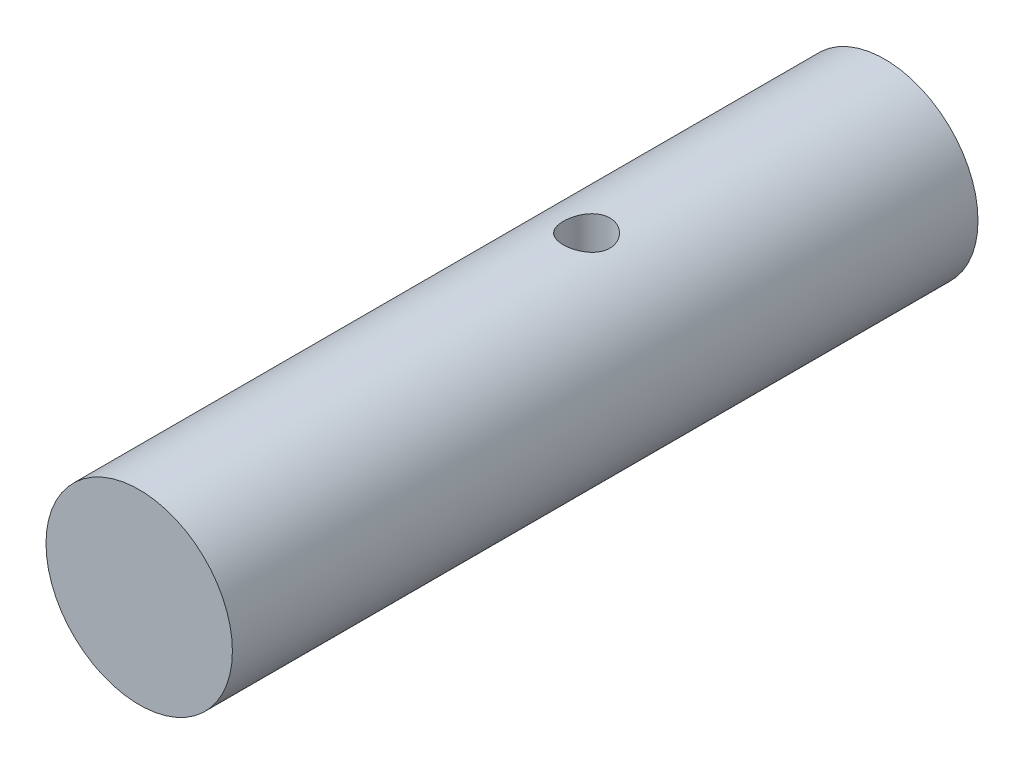
ISO-10303-21;
HEADER;
FILE_DESCRIPTION(('STEP AP214'),'2;1');
FILE_NAME('part.step','',(''),(''),'','','');
FILE_SCHEMA(('AUTOMOTIVE_DESIGN { 1 0 10303 214 1 1 1 1 }'));
ENDSEC;
DATA;
#1=APPLICATION_CONTEXT('core data for automotive mechanical design processes');
#2=APPLICATION_PROTOCOL_DEFINITION('international standard','automotive_design',2000,#1);
#3=PRODUCT_CONTEXT('',#1,'mechanical');
#4=PRODUCT('Part','Part','',(#3));
#5=PRODUCT_RELATED_PRODUCT_CATEGORY('part','',(#4));
#6=PRODUCT_DEFINITION_FORMATION('','',#4);
#7=PRODUCT_DEFINITION_CONTEXT('part definition',#1,'design');
#8=PRODUCT_DEFINITION('design','',#6,#7);
#9=PRODUCT_DEFINITION_SHAPE('','',#8);
#10=(LENGTH_UNIT() NAMED_UNIT(*) SI_UNIT(.MILLI.,.METRE.));
#11=(NAMED_UNIT(*) PLANE_ANGLE_UNIT() SI_UNIT($,.RADIAN.));
#12=(NAMED_UNIT(*) SI_UNIT($,.STERADIAN.) SOLID_ANGLE_UNIT());
#13=UNCERTAINTY_MEASURE_WITH_UNIT(LENGTH_MEASURE(1.E-05),#10,'distance_accuracy_value','');
#14=(GEOMETRIC_REPRESENTATION_CONTEXT(3) GLOBAL_UNCERTAINTY_ASSIGNED_CONTEXT((#13)) GLOBAL_UNIT_ASSIGNED_CONTEXT((#10,
#11,#12)) REPRESENTATION_CONTEXT('',''));
#15=CARTESIAN_POINT('',(0.,0.,0.));
#16=DIRECTION('',(0.,0.,1.));
#17=DIRECTION('',(1.,0.,0.));
#18=AXIS2_PLACEMENT_3D('',#15,#16,#17);
#19=CARTESIAN_POINT('',(0.,0.,40.));
#20=DIRECTION('',(0.,0.,-1.));
#21=DIRECTION('',(-1.,0.,0.));
#22=AXIS2_PLACEMENT_3D('',#19,#20,#21);
#23=CYLINDRICAL_SURFACE('',#22,5.);
#24=CARTESIAN_POINT('',(0.,-5.,17.25));
#25=CARTESIAN_POINT('',(0.0690634072247779,-4.99999883223344,17.2499980618849));
#26=CARTESIAN_POINT('',(0.138148464858971,-4.99855481776523,17.2442570410218));
#27=CARTESIAN_POINT('',(0.274338603142113,-4.99293428191577,17.2214790405775));
#28=CARTESIAN_POINT('',(0.341442539058951,-4.98875621183307,17.2044356587185));
#29=CARTESIAN_POINT('',(0.47168406015215,-4.97813021943367,17.1596339554483));
#30=CARTESIAN_POINT('',(0.53482630285834,-4.97168502368406,17.1318885010706));
#31=CARTESIAN_POINT('',(0.655560109920359,-4.95721119839661,17.066515508296));
#32=CARTESIAN_POINT('',(0.713151486957302,-4.94918251545042,17.0288876365675));
#33=CARTESIAN_POINT('',(0.822334939417436,-4.93222844659834,16.9439993419548));
#34=CARTESIAN_POINT('',(0.873796408384229,-4.92328922623777,16.896573687534));
#35=CARTESIAN_POINT('',(0.968124106002756,-4.90561350097941,16.7937898292426));
#36=CARTESIAN_POINT('',(1.01098936412428,-4.89687701906957,16.7384307308779));
#37=CARTESIAN_POINT('',(1.0875221189992,-4.88045646416425,16.6203373110521));
#38=CARTESIAN_POINT('',(1.12104351327113,-4.87278995392171,16.5575056409913));
#39=CARTESIAN_POINT('',(1.17699742379211,-4.85957912343519,16.426876323618));
#40=CARTESIAN_POINT('',(1.19943171286611,-4.85403446393991,16.3590794722285));
#41=CARTESIAN_POINT('',(1.23212903067024,-4.84583730597959,16.2218804181646));
#42=CARTESIAN_POINT('',(1.24262689027778,-4.84312909229521,16.1525375866252));
#43=CARTESIAN_POINT('',(1.25188481255655,-4.84074468781451,16.0130261924883));
#44=CARTESIAN_POINT('',(1.25064678484832,-4.8410680037387,15.9428577660845));
#45=CARTESIAN_POINT('',(1.2366554371994,-4.84466004580515,15.8054868268796));
#46=CARTESIAN_POINT('',(1.22418195015877,-4.84785719168233,15.7382536487791));
#47=CARTESIAN_POINT('',(1.18852015575259,-4.85672258063736,15.6068657909073));
#48=CARTESIAN_POINT('',(1.16533108505785,-4.8623909997558,15.5427113308092));
#49=CARTESIAN_POINT('',(1.10865789828096,-4.87562594920155,15.4185516531233));
#50=CARTESIAN_POINT('',(1.07507222269409,-4.88321106224517,15.358594856842));
#51=CARTESIAN_POINT('',(0.998630230012464,-4.89941425705322,15.2450677418693));
#52=CARTESIAN_POINT('',(0.955772290674035,-4.90803251945613,15.1914985432773));
#53=CARTESIAN_POINT('',(0.860552853901017,-4.92563233783151,15.090663653588));
#54=CARTESIAN_POINT('',(0.807955215138219,-4.93461724564976,15.0436212582822));
#55=CARTESIAN_POINT('',(0.695509931253086,-4.95171637982321,14.9589822979467));
#56=CARTESIAN_POINT('',(0.635662064756622,-4.95983057957846,14.921386021447));
#57=CARTESIAN_POINT('',(0.510096573901162,-4.97431443411819,14.8566245114797));
#58=CARTESIAN_POINT('',(0.444359494340522,-4.98067800106438,14.829495549788));
#59=CARTESIAN_POINT('',(0.309063340119072,-4.99089930826182,14.7867355785754));
#60=CARTESIAN_POINT('',(0.239504999292073,-4.99475752782734,14.7711023696516));
#61=CARTESIAN_POINT('',(0.100449975325025,-4.99946249392812,14.7521186953676));
#62=CARTESIAN_POINT('',(0.0309972666568442,-5.00038377923565,14.7484641449372));
#63=CARTESIAN_POINT('',(-0.107527395667921,-4.99932337345376,14.7527075017129));
#64=CARTESIAN_POINT('',(-0.17659938303716,-4.99734194368205,14.7606043689993));
#65=CARTESIAN_POINT('',(-0.311345223980408,-4.99074650939464,14.7874757569928));
#66=CARTESIAN_POINT('',(-0.377054265807293,-4.98617195154843,14.8062843862308));
#67=CARTESIAN_POINT('',(-0.504381077043757,-4.97490588861778,14.854255903357));
#68=CARTESIAN_POINT('',(-0.565998432527193,-4.9682141697491,14.8834198369276));
#69=CARTESIAN_POINT('',(-0.684602612024871,-4.95327756605259,14.9518634407289));
#70=CARTESIAN_POINT('',(-0.741487868196523,-4.94500722805777,14.9913134269973));
#71=CARTESIAN_POINT('',(-0.847938844702703,-4.92787090989516,15.0789915906641));
#72=CARTESIAN_POINT('',(-0.897503299144171,-4.91900482709754,15.1272212830141));
#73=CARTESIAN_POINT('',(-0.989158806727273,-4.90140797467309,15.2325016340371));
#74=CARTESIAN_POINT('',(-1.03103655635169,-4.89268586822734,15.289739752502));
#75=CARTESIAN_POINT('',(-1.10459229917725,-4.87660731981032,15.4106105287214));
#76=CARTESIAN_POINT('',(-1.13627074513161,-4.86925081722522,15.4742429024665));
#77=CARTESIAN_POINT('',(-1.18829285050774,-4.85681745612221,15.6057547686776));
#78=CARTESIAN_POINT('',(-1.20870366387839,-4.85172712743255,15.6736063569533));
#79=CARTESIAN_POINT('',(-1.23778804996148,-4.84438953408486,15.8119246982409));
#80=CARTESIAN_POINT('',(-1.24646418956555,-4.84214164766613,15.8823908758604));
#81=CARTESIAN_POINT('',(-1.25169882527833,-4.84079084336631,16.0217675198793));
#82=CARTESIAN_POINT('',(-1.2485982481501,-4.8415994394022,16.0906645292706));
#83=CARTESIAN_POINT('',(-1.23114773192739,-4.84606590839869,16.2269199072233));
#84=CARTESIAN_POINT('',(-1.21679801890564,-4.84972372409881,16.294278306678));
#85=CARTESIAN_POINT('',(-1.17744276620233,-4.85942717235602,16.4251737158878));
#86=CARTESIAN_POINT('',(-1.15250117056698,-4.86545846030258,16.4887310877002));
#87=CARTESIAN_POINT('',(-1.09272076133756,-4.87923129770691,16.6108044855947));
#88=CARTESIAN_POINT('',(-1.05788057502849,-4.88697308433977,16.6693198109891));
#89=CARTESIAN_POINT('',(-0.978223123864279,-4.90354695219593,16.7812955241684));
#90=CARTESIAN_POINT('',(-0.933169302426877,-4.91240220693131,16.8345842278533));
#91=CARTESIAN_POINT('',(-0.834824475991443,-4.93006689371905,16.9329558706628));
#92=CARTESIAN_POINT('',(-0.781531517717618,-4.93887631439216,16.9780368584275));
#93=CARTESIAN_POINT('',(-0.667056322252155,-4.95564713039719,17.0595094238038));
#94=CARTESIAN_POINT('',(-0.605748685263653,-4.9635902780489,17.0957288447263));
#95=CARTESIAN_POINT('',(-0.477721716258729,-4.97754104145932,17.1572895524504));
#96=CARTESIAN_POINT('',(-0.411006302863948,-4.98355004333151,17.1826386338738));
#97=CARTESIAN_POINT('',(-0.287008544369558,-4.99206716304618,17.2179765252747));
#98=CARTESIAN_POINT('',(-0.230316809090056,-4.99502154210576,17.2299593692112));
#99=CARTESIAN_POINT('',(-0.115755059613568,-4.9989883769329,17.245971619685));
#100=CARTESIAN_POINT('',(-0.0578851343688451,-5.00000097875745,17.2500016244211));
#101=CARTESIAN_POINT('',(0.,-5.,17.25));
#102=B_SPLINE_CURVE_WITH_KNOTS('',3,(#24,#25,#26,#27,#28,#29,#30,#31,#32,#33,#34,#35,#36,#37,
#38,#39,#40,#41,#42,#43,#44,#45,#46,#47,#48,#49,#50,#51,#52,#53,#54,#55,#56,#57,#58,#59,#60,#61,
#62,#63,#64,#65,#66,#67,#68,#69,#70,#71,#72,#73,#74,#75,#76,#77,#78,#79,#80,#81,#82,#83,#84,#85,
#86,#87,#88,#89,#90,#91,#92,#93,#94,#95,#96,#97,#98,#99,#100,#101),.UNSPECIFIED.,.T.,.F.,(4,2,2,
2,2,2,2,2,2,2,2,2,2,2,2,2,2,2,2,2,2,2,2,2,2,2,2,2,2,2,2,2,2,2,2,2,2,2,4),(0.,0.206978093726575,
0.414073531469917,0.620920751905091,0.827774950141108,1.03845362864283,1.24915607983385,
1.46298872954839,1.67678717641141,1.88630245916192,2.09578365093914,2.30018747505848,
2.50460586221699,2.71108773228233,2.91760575696802,3.13001250807516,3.34242574631872,
3.55556857507595,3.76867061407202,3.97631924124397,4.18394917593952,4.38850228761698,
4.59307606101909,4.80127989637793,5.00951969173349,5.2228709100373,5.4362126562459,
5.64826878845031,5.8602785271034,6.06619816998844,6.27211367463362,6.47680333799539,
6.68152140114084,6.89157980341592,7.10168808142015,7.3156015458299,7.52936136517792,
7.70285202451791,7.876329633692),.UNSPECIFIED.);
#103=CARTESIAN_POINT('',(0.,-5.,17.25));
#104=VERTEX_POINT('',#103);
#105=EDGE_CURVE('E10',#104,#104,#102,.T.);
#106=ORIENTED_EDGE('',*,*,#105,.T.);
#107=EDGE_LOOP('',(#106));
#108=FACE_BOUND('',#107,.T.);
#109=CARTESIAN_POINT('',(0.,5.,17.25));
#110=CARTESIAN_POINT('',(-0.0690634072247759,4.99999883223344,17.2499980618849));
#111=CARTESIAN_POINT('',(-0.138148464858969,4.99855481776523,17.2442570410218));
#112=CARTESIAN_POINT('',(-0.27433860314211,4.99293428191577,17.2214790405775));
#113=CARTESIAN_POINT('',(-0.341442539058949,4.98875621183307,17.2044356587185));
#114=CARTESIAN_POINT('',(-0.471684060152148,4.97813021943366,17.1596339554483));
#115=CARTESIAN_POINT('',(-0.534826302858337,4.97168502368406,17.1318885010706));
#116=CARTESIAN_POINT('',(-0.655560109920356,4.95721119839661,17.066515508296));
#117=CARTESIAN_POINT('',(-0.7131514869573,4.94918251545042,17.0288876365675));
#118=CARTESIAN_POINT('',(-0.822334939417433,4.93222844659834,16.9439993419548));
#119=CARTESIAN_POINT('',(-0.873796408384226,4.92328922623777,16.896573687534));
#120=CARTESIAN_POINT('',(-0.968124106002753,4.90561350097941,16.7937898292426));
#121=CARTESIAN_POINT('',(-1.01098936412428,4.89687701906957,16.7384307308779));
#122=CARTESIAN_POINT('',(-1.08752211899919,4.88045646416425,16.6203373110521));
#123=CARTESIAN_POINT('',(-1.12104351327113,4.87278995392171,16.5575056409913));
#124=CARTESIAN_POINT('',(-1.1769974237921,4.85957912343519,16.426876323618));
#125=CARTESIAN_POINT('',(-1.19943171286611,4.85403446393991,16.3590794722285));
#126=CARTESIAN_POINT('',(-1.23212903067024,4.84583730597959,16.2218804181646));
#127=CARTESIAN_POINT('',(-1.24262689027778,4.84312909229522,16.1525375866252));
#128=CARTESIAN_POINT('',(-1.25188481255654,4.84074468781451,16.0130261924884));
#129=CARTESIAN_POINT('',(-1.25064678484831,4.8410680037387,15.9428577660845));
#130=CARTESIAN_POINT('',(-1.2366554371994,4.84466004580515,15.8054868268796));
#131=CARTESIAN_POINT('',(-1.22418195015876,4.84785719168233,15.7382536487791));
#132=CARTESIAN_POINT('',(-1.18852015575259,4.85672258063736,15.6068657909073));
#133=CARTESIAN_POINT('',(-1.16533108505785,4.8623909997558,15.5427113308092));
#134=CARTESIAN_POINT('',(-1.10865789828096,4.87562594920156,15.4185516531233));
#135=CARTESIAN_POINT('',(-1.07507222269409,4.88321106224518,15.358594856842));
#136=CARTESIAN_POINT('',(-0.998630230012459,4.89941425705322,15.2450677418693));
#137=CARTESIAN_POINT('',(-0.955772290674029,4.90803251945613,15.1914985432773));
#138=CARTESIAN_POINT('',(-0.860552853901011,4.92563233783151,15.090663653588));
#139=CARTESIAN_POINT('',(-0.807955215138213,4.93461724564976,15.0436212582822));
#140=CARTESIAN_POINT('',(-0.695509931253079,4.95171637982321,14.9589822979467));
#141=CARTESIAN_POINT('',(-0.635662064756616,4.95983057957846,14.921386021447));
#142=CARTESIAN_POINT('',(-0.510096573901156,4.97431443411819,14.8566245114797));
#143=CARTESIAN_POINT('',(-0.444359494340515,4.98067800106438,14.829495549788));
#144=CARTESIAN_POINT('',(-0.309063340119064,4.99089930826182,14.7867355785754));
#145=CARTESIAN_POINT('',(-0.239504999292066,4.99475752782734,14.7711023696516));
#146=CARTESIAN_POINT('',(-0.100449975325018,4.99946249392812,14.7521186953676));
#147=CARTESIAN_POINT('',(-0.030997266656837,5.00038377923565,14.7484641449372));
#148=CARTESIAN_POINT('',(0.107527395667927,4.99932337345376,14.7527075017129));
#149=CARTESIAN_POINT('',(0.176599383037166,4.99734194368205,14.7606043689993));
#150=CARTESIAN_POINT('',(0.311345223980414,4.99074650939464,14.7874757569928));
#151=CARTESIAN_POINT('',(0.3770542658073,4.98617195154843,14.8062843862308));
#152=CARTESIAN_POINT('',(0.504381077043764,4.97490588861778,14.854255903357));
#153=CARTESIAN_POINT('',(0.5659984325272,4.9682141697491,14.8834198369276));
#154=CARTESIAN_POINT('',(0.684602612024877,4.95327756605259,14.9518634407289));
#155=CARTESIAN_POINT('',(0.74148786819653,4.94500722805777,14.9913134269973));
#156=CARTESIAN_POINT('',(0.84793884470271,4.92787090989516,15.0789915906641));
#157=CARTESIAN_POINT('',(0.897503299144177,4.91900482709754,15.1272212830141));
#158=CARTESIAN_POINT('',(0.989158806727279,4.90140797467309,15.2325016340371));
#159=CARTESIAN_POINT('',(1.0310365563517,4.89268586822734,15.289739752502));
#160=CARTESIAN_POINT('',(1.10459229917725,4.87660731981032,15.4106105287214));
#161=CARTESIAN_POINT('',(1.13627074513162,4.86925081722522,15.4742429024665));
#162=CARTESIAN_POINT('',(1.18829285050775,4.85681745612221,15.6057547686776));
#163=CARTESIAN_POINT('',(1.20870366387839,4.85172712743255,15.6736063569533));
#164=CARTESIAN_POINT('',(1.23778804996148,4.84438953408486,15.8119246982409));
#165=CARTESIAN_POINT('',(1.24646418956555,4.84214164766613,15.8823908758604));
#166=CARTESIAN_POINT('',(1.25169882527833,4.8407908433663,16.0217675198793));
#167=CARTESIAN_POINT('',(1.2485982481501,4.8415994394022,16.0906645292706));
#168=CARTESIAN_POINT('',(1.23114773192739,4.84606590839869,16.2269199072233));
#169=CARTESIAN_POINT('',(1.21679801890564,4.84972372409881,16.294278306678));
#170=CARTESIAN_POINT('',(1.17744276620233,4.85942717235602,16.4251737158878));
#171=CARTESIAN_POINT('',(1.15250117056698,4.86545846030258,16.4887310877002));
#172=CARTESIAN_POINT('',(1.09272076133756,4.8792312977069,16.6108044855947));
#173=CARTESIAN_POINT('',(1.05788057502849,4.88697308433978,16.6693198109891));
#174=CARTESIAN_POINT('',(0.97822312386428,4.90354695219593,16.7812955241684));
#175=CARTESIAN_POINT('',(0.933169302426877,4.91240220693131,16.8345842278533));
#176=CARTESIAN_POINT('',(0.834824475991444,4.93006689371905,16.9329558706628));
#177=CARTESIAN_POINT('',(0.781531517717619,4.93887631439216,16.9780368584275));
#178=CARTESIAN_POINT('',(0.667056322252158,4.95564713039719,17.0595094238038));
#179=CARTESIAN_POINT('',(0.605748685263656,4.9635902780489,17.0957288447263));
#180=CARTESIAN_POINT('',(0.477721716258731,4.97754104145932,17.1572895524504));
#181=CARTESIAN_POINT('',(0.41100630286395,4.98355004333151,17.1826386338738));
#182=CARTESIAN_POINT('',(0.28700854436956,4.99206716304618,17.2179765252747));
#183=CARTESIAN_POINT('',(0.230316809090057,4.99502154210576,17.2299593692112));
#184=CARTESIAN_POINT('',(0.115755059613569,4.9989883769329,17.245971619685));
#185=CARTESIAN_POINT('',(0.0578851343688469,5.00000097875745,17.2500016244211));
#186=CARTESIAN_POINT('',(0.,5.,17.25));
#187=B_SPLINE_CURVE_WITH_KNOTS('',3,(#109,#110,#111,#112,#113,#114,#115,#116,#117,#118,#119,
#120,#121,#122,#123,#124,#125,#126,#127,#128,#129,#130,#131,#132,#133,#134,#135,#136,#137,#138,
#139,#140,#141,#142,#143,#144,#145,#146,#147,#148,#149,#150,#151,#152,#153,#154,#155,#156,#157,
#158,#159,#160,#161,#162,#163,#164,#165,#166,#167,#168,#169,#170,#171,#172,#173,#174,#175,#176,
#177,#178,#179,#180,#181,#182,#183,#184,#185,#186),.UNSPECIFIED.,.T.,.F.,(4,2,2,2,2,2,2,2,2,2,2,
2,2,2,2,2,2,2,2,2,2,2,2,2,2,2,2,2,2,2,2,2,2,2,2,2,2,2,4),(0.,0.206978093726575,
0.414073531469917,0.62092075190509,0.827774950141107,1.03845362864283,1.24915607983385,
1.46298872954839,1.6767871764114,1.88630245916192,2.09578365093914,2.30018747505848,
2.50460586221699,2.71108773228233,2.91760575696802,3.13001250807516,3.34242574631873,
3.55556857507595,3.76867061407202,3.97631924124397,4.18394917593952,4.38850228761698,
4.59307606101909,4.80127989637793,5.00951969173349,5.2228709100373,5.4362126562459,
5.6482687884503,5.8602785271034,6.06619816998843,6.27211367463362,6.47680333799539,
6.68152140114084,6.89157980341592,7.10168808142015,7.3156015458299,7.52936136517791,
7.70285202451791,7.876329633692),.UNSPECIFIED.);
#188=CARTESIAN_POINT('',(0.,5.,17.25));
#189=VERTEX_POINT('',#188);
#190=EDGE_CURVE('E50',#189,#189,#187,.T.);
#191=ORIENTED_EDGE('',*,*,#190,.T.);
#192=EDGE_LOOP('',(#191));
#193=FACE_BOUND('',#192,.T.);
#194=CARTESIAN_POINT('',(0.,0.,40.));
#195=DIRECTION('',(0.,0.,1.));
#196=DIRECTION('',(1.,0.,0.));
#197=AXIS2_PLACEMENT_3D('',#194,#195,#196);
#198=CIRCLE('',#197,5.);
#199=CARTESIAN_POINT('',(5.,0.,40.));
#200=VERTEX_POINT('',#199);
#201=EDGE_CURVE('E54',#200,#200,#198,.T.);
#202=ORIENTED_EDGE('',*,*,#201,.F.);
#203=EDGE_LOOP('',(#202));
#204=FACE_BOUND('',#203,.T.);
#205=CARTESIAN_POINT('',(0.,0.,0.));
#206=DIRECTION('',(0.,0.,1.));
#207=DIRECTION('',(1.,0.,0.));
#208=AXIS2_PLACEMENT_3D('',#205,#206,#207);
#209=CIRCLE('',#208,5.);
#210=CARTESIAN_POINT('',(5.,0.,0.));
#211=VERTEX_POINT('',#210);
#212=EDGE_CURVE('E58',#211,#211,#209,.T.);
#213=ORIENTED_EDGE('',*,*,#212,.T.);
#214=EDGE_LOOP('',(#213));
#215=FACE_BOUND('',#214,.T.);
#216=ADVANCED_FACE('F39',(#108,#193,#204,#215),#23,.T.);
#217=CARTESIAN_POINT('',(0.,0.,40.));
#218=DIRECTION('',(0.,0.,1.));
#219=DIRECTION('',(1.,0.,0.));
#220=AXIS2_PLACEMENT_3D('',#217,#218,#219);
#221=PLANE('',#220);
#222=ORIENTED_EDGE('',*,*,#201,.T.);
#223=EDGE_LOOP('',(#222));
#224=FACE_BOUND('',#223,.T.);
#225=ADVANCED_FACE('F70',(#224),#221,.T.);
#226=CARTESIAN_POINT('',(0.,0.,0.));
#227=DIRECTION('',(0.,0.,1.));
#228=DIRECTION('',(1.,0.,0.));
#229=AXIS2_PLACEMENT_3D('',#226,#227,#228);
#230=PLANE('',#229);
#231=ORIENTED_EDGE('',*,*,#212,.F.);
#232=EDGE_LOOP('',(#231));
#233=FACE_BOUND('',#232,.T.);
#234=ADVANCED_FACE('F68',(#233),#230,.F.);
#235=CARTESIAN_POINT('',(0.,-5.,16.));
#236=DIRECTION('',(0.,1.,0.));
#237=DIRECTION('',(0.,0.,1.));
#238=AXIS2_PLACEMENT_3D('',#235,#236,#237);
#239=CYLINDRICAL_SURFACE('',#238,1.25);
#240=ORIENTED_EDGE('',*,*,#190,.F.);
#241=EDGE_LOOP('',(#240));
#242=FACE_BOUND('',#241,.T.);
#243=ORIENTED_EDGE('',*,*,#105,.F.);
#244=EDGE_LOOP('',(#243));
#245=FACE_BOUND('',#244,.T.);
#246=ADVANCED_FACE('F64',(#242,#245),#239,.F.);
#247=CLOSED_SHELL('',(#216,#225,#234,#246));
#248=MANIFOLD_SOLID_BREP('B2',#247);
#249=ADVANCED_BREP_SHAPE_REPRESENTATION('',(#18,#248),#14);
#250=SHAPE_DEFINITION_REPRESENTATION(#9,#249);
ENDSEC;
END-ISO-10303-21;
